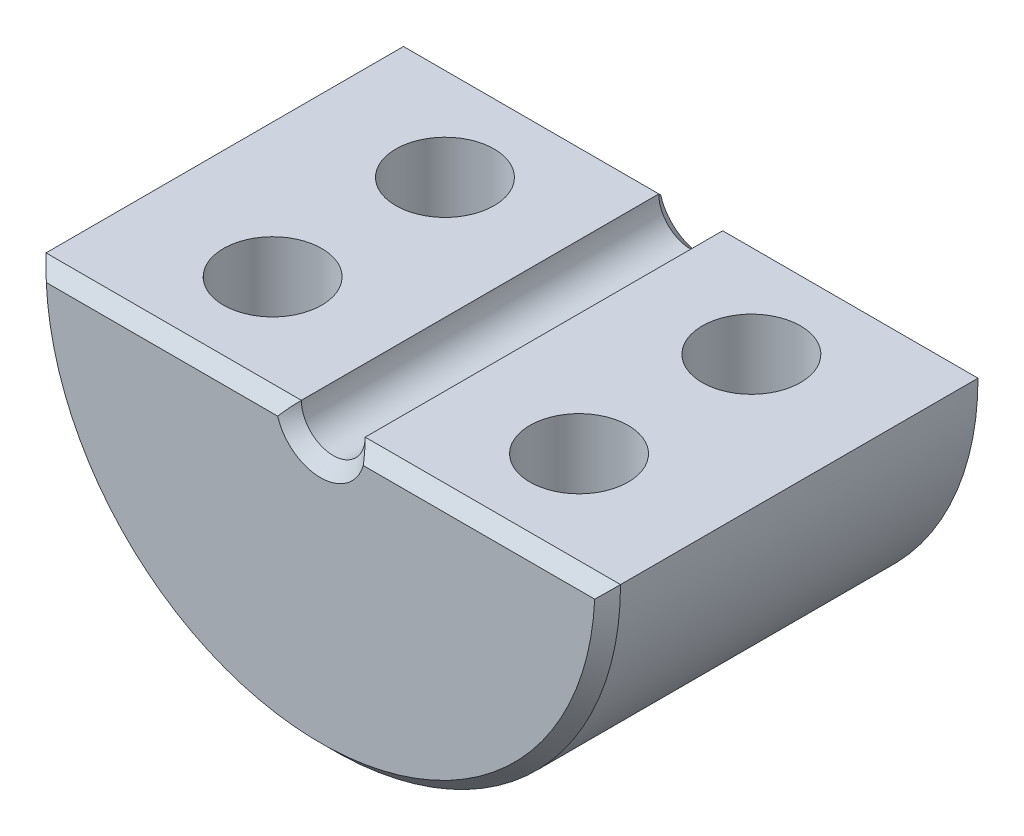
ISO-10303-21;
HEADER;
FILE_DESCRIPTION(('STEP AP214'),'2;1');
FILE_NAME('part.step','',(''),(''),'','','');
FILE_SCHEMA(('AUTOMOTIVE_DESIGN { 1 0 10303 214 1 1 1 1 }'));
ENDSEC;
DATA;
#1=APPLICATION_CONTEXT('core data for automotive mechanical design processes');
#2=APPLICATION_PROTOCOL_DEFINITION('international standard','automotive_design',2000,#1);
#3=PRODUCT_CONTEXT('',#1,'mechanical');
#4=PRODUCT('Part','Part','',(#3));
#5=PRODUCT_RELATED_PRODUCT_CATEGORY('part','',(#4));
#6=PRODUCT_DEFINITION_FORMATION('','',#4);
#7=PRODUCT_DEFINITION_CONTEXT('part definition',#1,'design');
#8=PRODUCT_DEFINITION('design','',#6,#7);
#9=PRODUCT_DEFINITION_SHAPE('','',#8);
#10=(LENGTH_UNIT() NAMED_UNIT(*) SI_UNIT(.MILLI.,.METRE.));
#11=(NAMED_UNIT(*) PLANE_ANGLE_UNIT() SI_UNIT($,.RADIAN.));
#12=(NAMED_UNIT(*) SI_UNIT($,.STERADIAN.) SOLID_ANGLE_UNIT());
#13=UNCERTAINTY_MEASURE_WITH_UNIT(LENGTH_MEASURE(1.E-05),#10,'distance_accuracy_value','');
#14=(GEOMETRIC_REPRESENTATION_CONTEXT(3) GLOBAL_UNCERTAINTY_ASSIGNED_CONTEXT((#13)) GLOBAL_UNIT_ASSIGNED_CONTEXT((#10,
#11,#12)) REPRESENTATION_CONTEXT('',''));
#15=CARTESIAN_POINT('',(0.,0.,0.));
#16=DIRECTION('',(0.,0.,1.));
#17=DIRECTION('',(1.,0.,0.));
#18=AXIS2_PLACEMENT_3D('',#15,#16,#17);
#19=CARTESIAN_POINT('',(0.,0.,15.24));
#20=DIRECTION('',(0.,0.,-1.));
#21=DIRECTION('',(-1.,0.,0.));
#22=AXIS2_PLACEMENT_3D('',#19,#20,#21);
#23=CYLINDRICAL_SURFACE('',#22,1.27);
#24=DIRECTION('',(0.,0.,-1.));
#25=VECTOR('',#24,1.);
#26=CARTESIAN_POINT('',(-1.27,0.,15.24));
#27=LINE('',#26,#25);
#28=CARTESIAN_POINT('',(-1.27,0.,14.732));
#29=VERTEX_POINT('',#28);
#30=CARTESIAN_POINT('',(-1.27,0.,0.508000000000029));
#31=VERTEX_POINT('',#30);
#32=EDGE_CURVE('E111',#29,#31,#27,.T.);
#33=ORIENTED_EDGE('',*,*,#32,.F.);
#34=CARTESIAN_POINT('',(0.,0.,14.732));
#35=DIRECTION('',(0.,0.,1.));
#36=DIRECTION('',(1.,0.,0.));
#37=AXIS2_PLACEMENT_3D('',#34,#35,#36);
#38=CIRCLE('',#37,1.27);
#39=CARTESIAN_POINT('',(1.27,0.,14.732));
#40=VERTEX_POINT('',#39);
#41=EDGE_CURVE('E11',#29,#40,#38,.T.);
#42=ORIENTED_EDGE('',*,*,#41,.T.);
#43=DIRECTION('',(0.,0.,-1.));
#44=VECTOR('',#43,1.);
#45=CARTESIAN_POINT('',(1.27,0.,15.24));
#46=LINE('',#45,#44);
#47=CARTESIAN_POINT('',(1.27,0.,0.508000000000029));
#48=VERTEX_POINT('',#47);
#49=EDGE_CURVE('E184',#40,#48,#46,.T.);
#50=ORIENTED_EDGE('',*,*,#49,.T.);
#51=CARTESIAN_POINT('',(0.,0.,0.508000000000026));
#52=DIRECTION('',(0.,0.,1.));
#53=DIRECTION('',(1.,0.,0.));
#54=AXIS2_PLACEMENT_3D('',#51,#52,#53);
#55=CIRCLE('',#54,1.27);
#56=EDGE_CURVE('E147',#48,#31,#55,.F.);
#57=ORIENTED_EDGE('',*,*,#56,.T.);
#58=EDGE_LOOP('',(#33,#42,#50,#57));
#59=FACE_BOUND('',#58,.T.);
#60=ADVANCED_FACE('F35',(#59),#23,.F.);
#61=CARTESIAN_POINT('',(-11.43,0.,15.24));
#62=DIRECTION('',(0.,-1.,0.));
#63=DIRECTION('',(0.,0.,-1.));
#64=AXIS2_PLACEMENT_3D('',#61,#62,#63);
#65=PLANE('',#64);
#66=CARTESIAN_POINT('',(-6.096,0.,11.049));
#67=DIRECTION('',(0.,1.,0.));
#68=DIRECTION('',(0.,0.,1.));
#69=AXIS2_PLACEMENT_3D('',#66,#67,#68);
#70=CIRCLE('',#69,1.9558);
#71=CARTESIAN_POINT('',(-6.096,0.,13.0048));
#72=VERTEX_POINT('',#71);
#73=EDGE_CURVE('E293',#72,#72,#70,.T.);
#74=ORIENTED_EDGE('',*,*,#73,.F.);
#75=EDGE_LOOP('',(#74));
#76=FACE_BOUND('',#75,.T.);
#77=CARTESIAN_POINT('',(-6.096,0.,4.19100000000003));
#78=DIRECTION('',(0.,1.,0.));
#79=DIRECTION('',(0.,0.,1.));
#80=AXIS2_PLACEMENT_3D('',#77,#78,#79);
#81=CIRCLE('',#80,1.9558);
#82=CARTESIAN_POINT('',(-6.096,0.,6.14680000000003));
#83=VERTEX_POINT('',#82);
#84=EDGE_CURVE('E292',#83,#83,#81,.T.);
#85=ORIENTED_EDGE('',*,*,#84,.F.);
#86=EDGE_LOOP('',(#85));
#87=FACE_BOUND('',#86,.T.);
#88=DIRECTION('',(0.,0.,-1.));
#89=VECTOR('',#88,1.);
#90=CARTESIAN_POINT('',(-11.43,0.,15.24));
#91=LINE('',#90,#89);
#92=CARTESIAN_POINT('',(-11.43,0.,14.732));
#93=VERTEX_POINT('',#92);
#94=CARTESIAN_POINT('',(-11.43,0.,0.508000000000029));
#95=VERTEX_POINT('',#94);
#96=EDGE_CURVE('E104',#93,#95,#91,.T.);
#97=ORIENTED_EDGE('',*,*,#96,.F.);
#98=DIRECTION('',(1.,0.,0.));
#99=VECTOR('',#98,1.);
#100=CARTESIAN_POINT('',(-1.27,0.,14.732));
#101=LINE('',#100,#99);
#102=EDGE_CURVE('E49',#93,#29,#101,.T.);
#103=ORIENTED_EDGE('',*,*,#102,.T.);
#104=ORIENTED_EDGE('',*,*,#32,.T.);
#105=DIRECTION('',(-1.,0.,0.));
#106=VECTOR('',#105,1.);
#107=CARTESIAN_POINT('',(-11.43,0.,0.508000000000026));
#108=LINE('',#107,#106);
#109=EDGE_CURVE('E120',#31,#95,#108,.T.);
#110=ORIENTED_EDGE('',*,*,#109,.T.);
#111=EDGE_LOOP('',(#97,#103,#104,#110));
#112=FACE_BOUND('',#111,.T.);
#113=ADVANCED_FACE('F133',(#76,#87,#112),#65,.F.);
#114=CARTESIAN_POINT('',(0.,0.,15.24));
#115=DIRECTION('',(0.,0.,-1.));
#116=DIRECTION('',(-1.,0.,0.));
#117=AXIS2_PLACEMENT_3D('',#114,#115,#116);
#118=CYLINDRICAL_SURFACE('',#117,11.43);
#119=DIRECTION('',(0.,0.,-1.));
#120=VECTOR('',#119,1.);
#121=CARTESIAN_POINT('',(11.43,0.,15.24));
#122=LINE('',#121,#120);
#123=CARTESIAN_POINT('',(11.43,0.,14.732));
#124=VERTEX_POINT('',#123);
#125=CARTESIAN_POINT('',(11.43,0.,0.508000000000029));
#126=VERTEX_POINT('',#125);
#127=EDGE_CURVE('E112',#124,#126,#122,.T.);
#128=ORIENTED_EDGE('',*,*,#127,.F.);
#129=CARTESIAN_POINT('',(0.,0.,14.732));
#130=DIRECTION('',(0.,0.,1.));
#131=DIRECTION('',(1.,0.,0.));
#132=AXIS2_PLACEMENT_3D('',#129,#130,#131);
#133=CIRCLE('',#132,11.43);
#134=EDGE_CURVE('E64',#124,#93,#133,.F.);
#135=ORIENTED_EDGE('',*,*,#134,.T.);
#136=ORIENTED_EDGE('',*,*,#96,.T.);
#137=CARTESIAN_POINT('',(0.,0.,0.508000000000026));
#138=DIRECTION('',(0.,0.,1.));
#139=DIRECTION('',(1.,0.,0.));
#140=AXIS2_PLACEMENT_3D('',#137,#138,#139);
#141=CIRCLE('',#140,11.43);
#142=EDGE_CURVE('E108',#95,#126,#141,.T.);
#143=ORIENTED_EDGE('',*,*,#142,.T.);
#144=EDGE_LOOP('',(#128,#135,#136,#143));
#145=FACE_BOUND('',#144,.T.);
#146=ADVANCED_FACE('F106',(#145),#118,.T.);
#147=CARTESIAN_POINT('',(1.27,0.,15.24));
#148=DIRECTION('',(0.,-1.,0.));
#149=DIRECTION('',(0.,0.,-1.));
#150=AXIS2_PLACEMENT_3D('',#147,#148,#149);
#151=PLANE('',#150);
#152=CARTESIAN_POINT('',(6.096,0.,4.19100000000003));
#153=DIRECTION('',(0.,1.,0.));
#154=DIRECTION('',(0.,0.,-1.));
#155=AXIS2_PLACEMENT_3D('',#152,#153,#154);
#156=CIRCLE('',#155,1.9558);
#157=CARTESIAN_POINT('',(6.096,0.,2.23520000000003));
#158=VERTEX_POINT('',#157);
#159=EDGE_CURVE('E309',#158,#158,#156,.T.);
#160=ORIENTED_EDGE('',*,*,#159,.F.);
#161=EDGE_LOOP('',(#160));
#162=FACE_BOUND('',#161,.T.);
#163=CARTESIAN_POINT('',(6.096,0.,11.049));
#164=DIRECTION('',(0.,1.,0.));
#165=DIRECTION('',(0.,0.,-1.));
#166=AXIS2_PLACEMENT_3D('',#163,#164,#165);
#167=CIRCLE('',#166,1.9558);
#168=CARTESIAN_POINT('',(6.096,0.,9.09320000000001));
#169=VERTEX_POINT('',#168);
#170=EDGE_CURVE('E303',#169,#169,#167,.T.);
#171=ORIENTED_EDGE('',*,*,#170,.F.);
#172=EDGE_LOOP('',(#171));
#173=FACE_BOUND('',#172,.T.);
#174=ORIENTED_EDGE('',*,*,#49,.F.);
#175=DIRECTION('',(1.,0.,0.));
#176=VECTOR('',#175,1.);
#177=CARTESIAN_POINT('',(11.43,0.,14.732));
#178=LINE('',#177,#176);
#179=EDGE_CURVE('E197',#40,#124,#178,.T.);
#180=ORIENTED_EDGE('',*,*,#179,.T.);
#181=ORIENTED_EDGE('',*,*,#127,.T.);
#182=DIRECTION('',(-1.,0.,0.));
#183=VECTOR('',#182,1.);
#184=CARTESIAN_POINT('',(1.27,0.,0.508000000000026));
#185=LINE('',#184,#183);
#186=EDGE_CURVE('E131',#126,#48,#185,.T.);
#187=ORIENTED_EDGE('',*,*,#186,.T.);
#188=EDGE_LOOP('',(#174,#180,#181,#187));
#189=FACE_BOUND('',#188,.T.);
#190=ADVANCED_FACE('F245',(#162,#173,#189),#151,.F.);
#191=CARTESIAN_POINT('',(0.,0.,15.24));
#192=DIRECTION('',(0.,0.,1.));
#193=DIRECTION('',(1.,0.,0.));
#194=AXIS2_PLACEMENT_3D('',#191,#192,#193);
#195=PLANE('',#194);
#196=CARTESIAN_POINT('',(0.,0.,15.24));
#197=DIRECTION('',(0.,0.,1.));
#198=DIRECTION('',(1.,0.,0.));
#199=AXIS2_PLACEMENT_3D('',#196,#197,#198);
#200=CIRCLE('',#199,10.922);
#201=CARTESIAN_POINT('',(-10.9101796502166,-0.507999999999977,15.24));
#202=VERTEX_POINT('',#201);
#203=CARTESIAN_POINT('',(10.9101796502166,-0.507999999999977,15.24));
#204=VERTEX_POINT('',#203);
#205=EDGE_CURVE('E192',#202,#204,#200,.T.);
#206=ORIENTED_EDGE('',*,*,#205,.T.);
#207=DIRECTION('',(-1.,0.,0.));
#208=VECTOR('',#207,1.);
#209=CARTESIAN_POINT('',(1.27,-0.507999999999977,15.24));
#210=LINE('',#209,#208);
#211=CARTESIAN_POINT('',(1.70388379885482,-0.507999999999977,15.24));
#212=VERTEX_POINT('',#211);
#213=EDGE_CURVE('E194',#204,#212,#210,.T.);
#214=ORIENTED_EDGE('',*,*,#213,.T.);
#215=CARTESIAN_POINT('',(0.,0.,15.24));
#216=DIRECTION('',(0.,0.,1.));
#217=DIRECTION('',(1.,0.,0.));
#218=AXIS2_PLACEMENT_3D('',#215,#216,#217);
#219=CIRCLE('',#218,1.77799999999998);
#220=CARTESIAN_POINT('',(-1.70388379885482,-0.507999999999977,15.24));
#221=VERTEX_POINT('',#220);
#222=EDGE_CURVE('E148',#212,#221,#219,.F.);
#223=ORIENTED_EDGE('',*,*,#222,.T.);
#224=DIRECTION('',(-1.,0.,0.));
#225=VECTOR('',#224,1.);
#226=CARTESIAN_POINT('',(-11.43,-0.507999999999977,15.24));
#227=LINE('',#226,#225);
#228=EDGE_CURVE('E190',#221,#202,#227,.T.);
#229=ORIENTED_EDGE('',*,*,#228,.T.);
#230=EDGE_LOOP('',(#206,#214,#223,#229));
#231=FACE_BOUND('',#230,.T.);
#232=ADVANCED_FACE('F248',(#231),#195,.T.);
#233=CARTESIAN_POINT('',(0.,0.,0.));
#234=DIRECTION('',(0.,0.,1.));
#235=DIRECTION('',(1.,0.,0.));
#236=AXIS2_PLACEMENT_3D('',#233,#234,#235);
#237=PLANE('',#236);
#238=CARTESIAN_POINT('',(0.,0.,0.));
#239=DIRECTION('',(0.,0.,1.));
#240=DIRECTION('',(1.,0.,0.));
#241=AXIS2_PLACEMENT_3D('',#238,#239,#240);
#242=CIRCLE('',#241,10.922);
#243=CARTESIAN_POINT('',(10.9101796502166,-0.508000000000029,0.));
#244=VERTEX_POINT('',#243);
#245=CARTESIAN_POINT('',(-10.9101796502166,-0.508000000000029,0.));
#246=VERTEX_POINT('',#245);
#247=EDGE_CURVE('E142',#244,#246,#242,.F.);
#248=ORIENTED_EDGE('',*,*,#247,.T.);
#249=DIRECTION('',(1.,0.,0.));
#250=VECTOR('',#249,1.);
#251=CARTESIAN_POINT('',(0.,-0.508000000000029,0.));
#252=LINE('',#251,#250);
#253=CARTESIAN_POINT('',(-1.70388379885486,-0.508000000000029,0.));
#254=VERTEX_POINT('',#253);
#255=EDGE_CURVE('E122',#246,#254,#252,.T.);
#256=ORIENTED_EDGE('',*,*,#255,.T.);
#257=CARTESIAN_POINT('',(0.,0.,0.));
#258=DIRECTION('',(0.,0.,1.));
#259=DIRECTION('',(1.,0.,0.));
#260=AXIS2_PLACEMENT_3D('',#257,#258,#259);
#261=CIRCLE('',#260,1.77800000000003);
#262=CARTESIAN_POINT('',(1.70388379885486,-0.508000000000029,0.));
#263=VERTEX_POINT('',#262);
#264=EDGE_CURVE('E135',#254,#263,#261,.T.);
#265=ORIENTED_EDGE('',*,*,#264,.T.);
#266=DIRECTION('',(1.,0.,0.));
#267=VECTOR('',#266,1.);
#268=CARTESIAN_POINT('',(0.,-0.508000000000029,0.));
#269=LINE('',#268,#267);
#270=EDGE_CURVE('E137',#263,#244,#269,.T.);
#271=ORIENTED_EDGE('',*,*,#270,.T.);
#272=EDGE_LOOP('',(#248,#256,#265,#271));
#273=FACE_BOUND('',#272,.T.);
#274=ADVANCED_FACE('F250',(#273),#237,.F.);
#275=CARTESIAN_POINT('',(1.27,0.,0.508000000000026));
#276=DIRECTION('',(0.,-0.707106781186545,0.70710678118655));
#277=DIRECTION('',(-1.,0.,0.));
#278=AXIS2_PLACEMENT_3D('',#275,#276,#277);
#279=PLANE('',#278);
#280=CARTESIAN_POINT('',(11.43,0.,0.508000000000026));
#281=CARTESIAN_POINT('',(11.3446864252166,-0.0853435460348219,0.422656453965204));
#282=CARTESIAN_POINT('',(11.2587113058625,-0.170348623243508,0.337651376756519));
#283=CARTESIAN_POINT('',(11.085437857771,-0.339681957516365,0.168318042483663));
#284=CARTESIAN_POINT('',(10.9981395271973,-0.424010213641022,0.0839897863590065));
#285=CARTESIAN_POINT('',(10.9101796502166,-0.508000000000029,0.));
#286=B_SPLINE_CURVE_WITH_KNOTS('',3,(#280,#281,#282,#283,#284,#285),.UNSPECIFIED.,.F.,.F.,(4,2,
4),(0.,0.443385866998628,0.886772349367122),.UNSPECIFIED.);
#287=EDGE_CURVE('E130',#244,#126,#286,.F.);
#288=ORIENTED_EDGE('',*,*,#287,.F.);
#289=ORIENTED_EDGE('',*,*,#270,.F.);
#290=CARTESIAN_POINT('',(1.27,0.,0.508000000000026));
#291=CARTESIAN_POINT('',(1.31042688666068,-0.0404526554335472,0.467547344566479));
#292=CARTESIAN_POINT('',(1.34959051198913,-0.0815208596191419,0.426479140380884));
#293=CARTESIAN_POINT('',(1.42566486667448,-0.164629228991249,0.343370771008778));
#294=CARTESIAN_POINT('',(1.46257789878751,-0.206668337894493,0.301331662105534));
#295=CARTESIAN_POINT('',(1.53449206147923,-0.291526217948321,0.216473782051706));
#296=CARTESIAN_POINT('',(1.56949400881164,-0.33434464543701,0.173655354563018));
#297=CARTESIAN_POINT('',(1.63786663353027,-0.420687304669706,0.0873126953303225));
#298=CARTESIAN_POINT('',(1.67123557983076,-0.464212222945666,0.0437877770543628));
#299=CARTESIAN_POINT('',(1.70388379885486,-0.508000000000029,0.));
#300=B_SPLINE_CURVE_WITH_KNOTS('',3,(#290,#291,#292,#293,#294,#295,#296,#297,#298,#299),
.UNSPECIFIED.,.F.,.F.,(4,2,2,2,4),(0.,0.210110734627612,0.420002750530562,0.629804349733324,
0.839823737141208),.UNSPECIFIED.);
#301=EDGE_CURVE('E177',#48,#263,#300,.T.);
#302=ORIENTED_EDGE('',*,*,#301,.F.);
#303=ORIENTED_EDGE('',*,*,#186,.F.);
#304=EDGE_LOOP('',(#288,#289,#302,#303));
#305=FACE_BOUND('',#304,.T.);
#306=ADVANCED_FACE('F171',(#305),#279,.F.);
#307=CARTESIAN_POINT('',(0.,0.,0.508000000000026));
#308=DIRECTION('',(0.,0.,-1.));
#309=DIRECTION('',(-1.,0.,0.));
#310=AXIS2_PLACEMENT_3D('',#307,#308,#309);
#311=CONICAL_SURFACE('',#310,1.27,0.785398163397452);
#312=ORIENTED_EDGE('',*,*,#301,.T.);
#313=ORIENTED_EDGE('',*,*,#264,.F.);
#314=CARTESIAN_POINT('',(-1.70388379885486,-0.508000000000029,0.));
#315=CARTESIAN_POINT('',(-1.67123557983076,-0.464212222945666,0.0437877770543627));
#316=CARTESIAN_POINT('',(-1.63786663353027,-0.420687304669706,0.0873126953303225));
#317=CARTESIAN_POINT('',(-1.56949400881164,-0.33434464543701,0.173655354563018));
#318=CARTESIAN_POINT('',(-1.53449206147923,-0.291526217948321,0.216473782051706));
#319=CARTESIAN_POINT('',(-1.46257789878751,-0.206668337894493,0.301331662105534));
#320=CARTESIAN_POINT('',(-1.42566486667448,-0.164629228991249,0.343370771008778));
#321=CARTESIAN_POINT('',(-1.34959051198913,-0.0815208596191418,0.426479140380885));
#322=CARTESIAN_POINT('',(-1.31042688666068,-0.0404526554335471,0.467547344566479));
#323=CARTESIAN_POINT('',(-1.27,0.,0.508000000000026));
#324=B_SPLINE_CURVE_WITH_KNOTS('',3,(#314,#315,#316,#317,#318,#319,#320,#321,#322,#323),
.UNSPECIFIED.,.F.,.F.,(4,2,2,2,4),(0.,0.210019387407885,0.419820986610646,0.629713002513596,
0.839823737141208),.UNSPECIFIED.);
#325=EDGE_CURVE('E125',#31,#254,#324,.F.);
#326=ORIENTED_EDGE('',*,*,#325,.F.);
#327=ORIENTED_EDGE('',*,*,#56,.F.);
#328=EDGE_LOOP('',(#312,#313,#326,#327));
#329=FACE_BOUND('',#328,.T.);
#330=ADVANCED_FACE('F166',(#329),#311,.F.);
#331=CARTESIAN_POINT('',(0.,0.,0.508000000000026));
#332=DIRECTION('',(0.,0.,1.));
#333=DIRECTION('',(1.,0.,0.));
#334=AXIS2_PLACEMENT_3D('',#331,#332,#333);
#335=CONICAL_SURFACE('',#334,11.43,0.785398163397452);
#336=ORIENTED_EDGE('',*,*,#287,.T.);
#337=ORIENTED_EDGE('',*,*,#142,.F.);
#338=CARTESIAN_POINT('',(-11.43,0.,0.508000000000026));
#339=CARTESIAN_POINT('',(-11.3446864252166,-0.0853435460348215,0.422656453965204));
#340=CARTESIAN_POINT('',(-11.2587113058625,-0.170348623243507,0.337651376756519));
#341=CARTESIAN_POINT('',(-11.085437857771,-0.339681957516364,0.168318042483664));
#342=CARTESIAN_POINT('',(-10.9981395271973,-0.424010213641022,0.0839897863590068));
#343=CARTESIAN_POINT('',(-10.9101796502166,-0.508000000000028,0.));
#344=B_SPLINE_CURVE_WITH_KNOTS('',3,(#338,#339,#340,#341,#342,#343),.UNSPECIFIED.,.F.,.F.,(4,2,
4),(0.,0.443385866998628,0.886772349367122),.UNSPECIFIED.);
#345=EDGE_CURVE('E118',#246,#95,#344,.F.);
#346=ORIENTED_EDGE('',*,*,#345,.F.);
#347=ORIENTED_EDGE('',*,*,#247,.F.);
#348=EDGE_LOOP('',(#336,#337,#346,#347));
#349=FACE_BOUND('',#348,.T.);
#350=ADVANCED_FACE('F128',(#349),#335,.T.);
#351=CARTESIAN_POINT('',(-11.43,0.,0.508000000000026));
#352=DIRECTION('',(0.,-0.707106781186545,0.70710678118655));
#353=DIRECTION('',(-1.,0.,0.));
#354=AXIS2_PLACEMENT_3D('',#351,#352,#353);
#355=PLANE('',#354);
#356=ORIENTED_EDGE('',*,*,#325,.T.);
#357=ORIENTED_EDGE('',*,*,#255,.F.);
#358=ORIENTED_EDGE('',*,*,#345,.T.);
#359=ORIENTED_EDGE('',*,*,#109,.F.);
#360=EDGE_LOOP('',(#356,#357,#358,#359));
#361=FACE_BOUND('',#360,.T.);
#362=ADVANCED_FACE('F119',(#361),#355,.F.);
#363=CARTESIAN_POINT('',(0.,-0.507999999999977,15.24));
#364=DIRECTION('',(0.,0.70710678118655,0.707106781186545));
#365=DIRECTION('',(1.,0.,0.));
#366=AXIS2_PLACEMENT_3D('',#363,#364,#365);
#367=PLANE('',#366);
#368=CARTESIAN_POINT('',(-1.27,0.,14.732));
#369=CARTESIAN_POINT('',(-1.31042688666068,-0.0404526554335433,14.7724526554336));
#370=CARTESIAN_POINT('',(-1.34959051198913,-0.081520859619134,14.8135208596192));
#371=CARTESIAN_POINT('',(-1.42566486667446,-0.164629228991233,14.8966292289913));
#372=CARTESIAN_POINT('',(-1.46257789878749,-0.206668337894472,14.9386683378945));
#373=CARTESIAN_POINT('',(-1.53449206147921,-0.291526217948291,15.0235262179483));
#374=CARTESIAN_POINT('',(-1.56949400881161,-0.334344645436975,15.066344645437));
#375=CARTESIAN_POINT('',(-1.63786663353023,-0.420687304669662,15.1526873046697));
#376=CARTESIAN_POINT('',(-1.67123557983073,-0.464212222945618,15.1962122229456));
#377=CARTESIAN_POINT('',(-1.70388379885482,-0.507999999999977,15.24));
#378=B_SPLINE_CURVE_WITH_KNOTS('',3,(#368,#369,#370,#371,#372,#373,#374,#375,#376,#377),
.UNSPECIFIED.,.F.,.F.,(4,2,2,2,4),(0.,0.210110734627593,0.420002750530522,0.629804349733262,
0.839823737141129),.UNSPECIFIED.);
#379=EDGE_CURVE('E326',#29,#221,#378,.T.);
#380=ORIENTED_EDGE('',*,*,#379,.F.);
#381=ORIENTED_EDGE('',*,*,#102,.F.);
#382=CARTESIAN_POINT('',(-11.43,0.,14.732));
#383=CARTESIAN_POINT('',(-11.3446864252166,-0.0853435460348127,14.8173435460348));
#384=CARTESIAN_POINT('',(-11.2587113058625,-0.17034862324349,14.9023486232435));
#385=CARTESIAN_POINT('',(-11.085437857771,-0.33968195751633,15.0716819575163));
#386=CARTESIAN_POINT('',(-10.9981395271973,-0.424010213640979,15.156010213641));
#387=CARTESIAN_POINT('',(-10.9101796502166,-0.507999999999977,15.24));
#388=B_SPLINE_CURVE_WITH_KNOTS('',3,(#382,#383,#384,#385,#386,#387),.UNSPECIFIED.,.F.,.F.,(4,2,
4),(0.,0.443385866998585,0.886772349367035),.UNSPECIFIED.);
#389=EDGE_CURVE('E40',#202,#93,#388,.F.);
#390=ORIENTED_EDGE('',*,*,#389,.F.);
#391=ORIENTED_EDGE('',*,*,#228,.F.);
#392=EDGE_LOOP('',(#380,#381,#390,#391));
#393=FACE_BOUND('',#392,.T.);
#394=ADVANCED_FACE('F37',(#393),#367,.T.);
#395=CARTESIAN_POINT('',(0.,0.,15.24));
#396=DIRECTION('',(0.,0.,-1.));
#397=DIRECTION('',(-1.,0.,0.));
#398=AXIS2_PLACEMENT_3D('',#395,#396,#397);
#399=CONICAL_SURFACE('',#398,10.922,0.785398163397445);
#400=ORIENTED_EDGE('',*,*,#389,.T.);
#401=ORIENTED_EDGE('',*,*,#134,.F.);
#402=CARTESIAN_POINT('',(11.43,0.,14.732));
#403=CARTESIAN_POINT('',(11.3446864252166,-0.0853435460348132,14.8173435460348));
#404=CARTESIAN_POINT('',(11.2587113058625,-0.17034862324349,14.9023486232435));
#405=CARTESIAN_POINT('',(11.085437857771,-0.33968195751633,15.0716819575163));
#406=CARTESIAN_POINT('',(10.9981395271973,-0.424010213640979,15.156010213641));
#407=CARTESIAN_POINT('',(10.9101796502166,-0.507999999999977,15.24));
#408=B_SPLINE_CURVE_WITH_KNOTS('',3,(#402,#403,#404,#405,#406,#407),.UNSPECIFIED.,.F.,.F.,(4,2,
4),(0.,0.443385866998584,0.886772349367036),.UNSPECIFIED.);
#409=EDGE_CURVE('E209',#204,#124,#408,.F.);
#410=ORIENTED_EDGE('',*,*,#409,.F.);
#411=ORIENTED_EDGE('',*,*,#205,.F.);
#412=EDGE_LOOP('',(#400,#401,#410,#411));
#413=FACE_BOUND('',#412,.T.);
#414=ADVANCED_FACE('F222',(#413),#399,.T.);
#415=CARTESIAN_POINT('',(0.,0.,15.24));
#416=DIRECTION('',(0.,0.,1.));
#417=DIRECTION('',(1.,0.,0.));
#418=AXIS2_PLACEMENT_3D('',#415,#416,#417);
#419=CONICAL_SURFACE('',#418,1.77799999999998,0.785398163397445);
#420=ORIENTED_EDGE('',*,*,#379,.T.);
#421=ORIENTED_EDGE('',*,*,#222,.F.);
#422=CARTESIAN_POINT('',(1.70388379885482,-0.507999999999977,15.24));
#423=CARTESIAN_POINT('',(1.67123557983073,-0.464212222945618,15.1962122229456));
#424=CARTESIAN_POINT('',(1.63786663353023,-0.420687304669662,15.1526873046697));
#425=CARTESIAN_POINT('',(1.56949400881161,-0.334344645436975,15.066344645437));
#426=CARTESIAN_POINT('',(1.53449206147921,-0.291526217948291,15.0235262179483));
#427=CARTESIAN_POINT('',(1.46257789878749,-0.206668337894472,14.9386683378945));
#428=CARTESIAN_POINT('',(1.42566486667446,-0.164629228991232,14.8966292289913));
#429=CARTESIAN_POINT('',(1.34959051198912,-0.0815208596191334,14.8135208596192));
#430=CARTESIAN_POINT('',(1.31042688666068,-0.0404526554335429,14.7724526554336));
#431=CARTESIAN_POINT('',(1.27,0.,14.732));
#432=B_SPLINE_CURVE_WITH_KNOTS('',3,(#422,#423,#424,#425,#426,#427,#428,#429,#430,#431),
.UNSPECIFIED.,.F.,.F.,(4,2,2,2,4),(0.,0.210019387407867,0.419820986610607,0.629713002513537,
0.83982373714113),.UNSPECIFIED.);
#433=EDGE_CURVE('E202',#40,#212,#432,.F.);
#434=ORIENTED_EDGE('',*,*,#433,.F.);
#435=ORIENTED_EDGE('',*,*,#41,.F.);
#436=EDGE_LOOP('',(#420,#421,#434,#435));
#437=FACE_BOUND('',#436,.T.);
#438=ADVANCED_FACE('F215',(#437),#419,.F.);
#439=CARTESIAN_POINT('',(0.,-0.507999999999977,15.24));
#440=DIRECTION('',(0.,0.70710678118655,0.707106781186545));
#441=DIRECTION('',(1.,0.,0.));
#442=AXIS2_PLACEMENT_3D('',#439,#440,#441);
#443=PLANE('',#442);
#444=ORIENTED_EDGE('',*,*,#409,.T.);
#445=ORIENTED_EDGE('',*,*,#179,.F.);
#446=ORIENTED_EDGE('',*,*,#433,.T.);
#447=ORIENTED_EDGE('',*,*,#213,.F.);
#448=EDGE_LOOP('',(#444,#445,#446,#447));
#449=FACE_BOUND('',#448,.T.);
#450=ADVANCED_FACE('F217',(#449),#443,.T.);
#451=CARTESIAN_POINT('',(6.096,-7.62,11.049));
#452=DIRECTION('',(0.,1.,0.));
#453=DIRECTION('',(0.,0.,1.));
#454=AXIS2_PLACEMENT_3D('',#451,#452,#453);
#455=CYLINDRICAL_SURFACE('',#454,1.9558);
#456=CARTESIAN_POINT('',(6.096,-7.62,11.049));
#457=DIRECTION('',(0.,1.,0.));
#458=DIRECTION('',(0.,0.,-1.));
#459=AXIS2_PLACEMENT_3D('',#456,#457,#458);
#460=CIRCLE('',#459,1.9558);
#461=CARTESIAN_POINT('',(6.096,-7.62,9.09320000000001));
#462=VERTEX_POINT('',#461);
#463=EDGE_CURVE('E298',#462,#462,#460,.T.);
#464=ORIENTED_EDGE('',*,*,#463,.F.);
#465=EDGE_LOOP('',(#464));
#466=FACE_BOUND('',#465,.T.);
#467=ORIENTED_EDGE('',*,*,#170,.T.);
#468=EDGE_LOOP('',(#467));
#469=FACE_BOUND('',#468,.T.);
#470=ADVANCED_FACE('F220',(#466,#469),#455,.F.);
#471=CARTESIAN_POINT('',(6.096,-7.62,11.049));
#472=DIRECTION('',(0.,-1.,0.));
#473=DIRECTION('',(0.,0.,-1.));
#474=AXIS2_PLACEMENT_3D('',#471,#472,#473);
#475=PLANE('',#474);
#476=ORIENTED_EDGE('',*,*,#463,.T.);
#477=EDGE_LOOP('',(#476));
#478=FACE_BOUND('',#477,.T.);
#479=ADVANCED_FACE('F270',(#478),#475,.F.);
#480=CARTESIAN_POINT('',(6.096,-7.62,4.19100000000003));
#481=DIRECTION('',(0.,1.,0.));
#482=DIRECTION('',(0.,0.,1.));
#483=AXIS2_PLACEMENT_3D('',#480,#481,#482);
#484=CYLINDRICAL_SURFACE('',#483,1.9558);
#485=CARTESIAN_POINT('',(6.096,-7.62,4.19100000000003));
#486=DIRECTION('',(0.,1.,0.));
#487=DIRECTION('',(0.,0.,-1.));
#488=AXIS2_PLACEMENT_3D('',#485,#486,#487);
#489=CIRCLE('',#488,1.9558);
#490=CARTESIAN_POINT('',(6.096,-7.62,2.23520000000003));
#491=VERTEX_POINT('',#490);
#492=EDGE_CURVE('E306',#491,#491,#489,.T.);
#493=ORIENTED_EDGE('',*,*,#492,.F.);
#494=EDGE_LOOP('',(#493));
#495=FACE_BOUND('',#494,.T.);
#496=ORIENTED_EDGE('',*,*,#159,.T.);
#497=EDGE_LOOP('',(#496));
#498=FACE_BOUND('',#497,.T.);
#499=ADVANCED_FACE('F267',(#495,#498),#484,.F.);
#500=CARTESIAN_POINT('',(6.096,-7.62,4.19100000000003));
#501=DIRECTION('',(0.,-1.,0.));
#502=DIRECTION('',(0.,0.,-1.));
#503=AXIS2_PLACEMENT_3D('',#500,#501,#502);
#504=PLANE('',#503);
#505=ORIENTED_EDGE('',*,*,#492,.T.);
#506=EDGE_LOOP('',(#505));
#507=FACE_BOUND('',#506,.T.);
#508=ADVANCED_FACE('F261',(#507),#504,.F.);
#509=CARTESIAN_POINT('',(-6.096,-7.62,4.19100000000003));
#510=DIRECTION('',(0.,1.,0.));
#511=DIRECTION('',(0.,0.,1.));
#512=AXIS2_PLACEMENT_3D('',#509,#510,#511);
#513=CYLINDRICAL_SURFACE('',#512,1.9558);
#514=CARTESIAN_POINT('',(-6.096,-7.62,4.19100000000003));
#515=DIRECTION('',(0.,1.,0.));
#516=DIRECTION('',(0.,0.,1.));
#517=AXIS2_PLACEMENT_3D('',#514,#515,#516);
#518=CIRCLE('',#517,1.9558);
#519=CARTESIAN_POINT('',(-6.096,-7.62,6.14680000000003));
#520=VERTEX_POINT('',#519);
#521=EDGE_CURVE('E210',#520,#520,#518,.T.);
#522=ORIENTED_EDGE('',*,*,#521,.F.);
#523=EDGE_LOOP('',(#522));
#524=FACE_BOUND('',#523,.T.);
#525=ORIENTED_EDGE('',*,*,#84,.T.);
#526=EDGE_LOOP('',(#525));
#527=FACE_BOUND('',#526,.T.);
#528=ADVANCED_FACE('F257',(#524,#527),#513,.F.);
#529=CARTESIAN_POINT('',(-6.096,-7.62,4.19100000000003));
#530=DIRECTION('',(0.,1.,0.));
#531=DIRECTION('',(0.,0.,1.));
#532=AXIS2_PLACEMENT_3D('',#529,#530,#531);
#533=PLANE('',#532);
#534=ORIENTED_EDGE('',*,*,#521,.T.);
#535=EDGE_LOOP('',(#534));
#536=FACE_BOUND('',#535,.T.);
#537=ADVANCED_FACE('F260',(#536),#533,.T.);
#538=CARTESIAN_POINT('',(-6.096,-7.62,11.049));
#539=DIRECTION('',(0.,1.,0.));
#540=DIRECTION('',(0.,0.,1.));
#541=AXIS2_PLACEMENT_3D('',#538,#539,#540);
#542=CYLINDRICAL_SURFACE('',#541,1.9558);
#543=CARTESIAN_POINT('',(-6.096,-7.62,11.049));
#544=DIRECTION('',(0.,1.,0.));
#545=DIRECTION('',(0.,0.,1.));
#546=AXIS2_PLACEMENT_3D('',#543,#544,#545);
#547=CIRCLE('',#546,1.9558);
#548=CARTESIAN_POINT('',(-6.096,-7.62,13.0048));
#549=VERTEX_POINT('',#548);
#550=EDGE_CURVE('E291',#549,#549,#547,.T.);
#551=ORIENTED_EDGE('',*,*,#550,.F.);
#552=EDGE_LOOP('',(#551));
#553=FACE_BOUND('',#552,.T.);
#554=ORIENTED_EDGE('',*,*,#73,.T.);
#555=EDGE_LOOP('',(#554));
#556=FACE_BOUND('',#555,.T.);
#557=ADVANCED_FACE('F265',(#553,#556),#542,.F.);
#558=CARTESIAN_POINT('',(-6.096,-7.62,11.049));
#559=DIRECTION('',(0.,1.,0.));
#560=DIRECTION('',(0.,0.,1.));
#561=AXIS2_PLACEMENT_3D('',#558,#559,#560);
#562=PLANE('',#561);
#563=ORIENTED_EDGE('',*,*,#550,.T.);
#564=EDGE_LOOP('',(#563));
#565=FACE_BOUND('',#564,.T.);
#566=ADVANCED_FACE('F283',(#565),#562,.T.);
#567=CLOSED_SHELL('',(#60,#113,#146,#190,#232,#274,#306,#330,#350,#362,#394,#414,#438,#450,#470,
#479,#499,#508,#528,#537,#557,#566));
#568=MANIFOLD_SOLID_BREP('B2',#567);
#569=ADVANCED_BREP_SHAPE_REPRESENTATION('',(#18,#568),#14);
#570=SHAPE_DEFINITION_REPRESENTATION(#9,#569);
ENDSEC;
END-ISO-10303-21;
